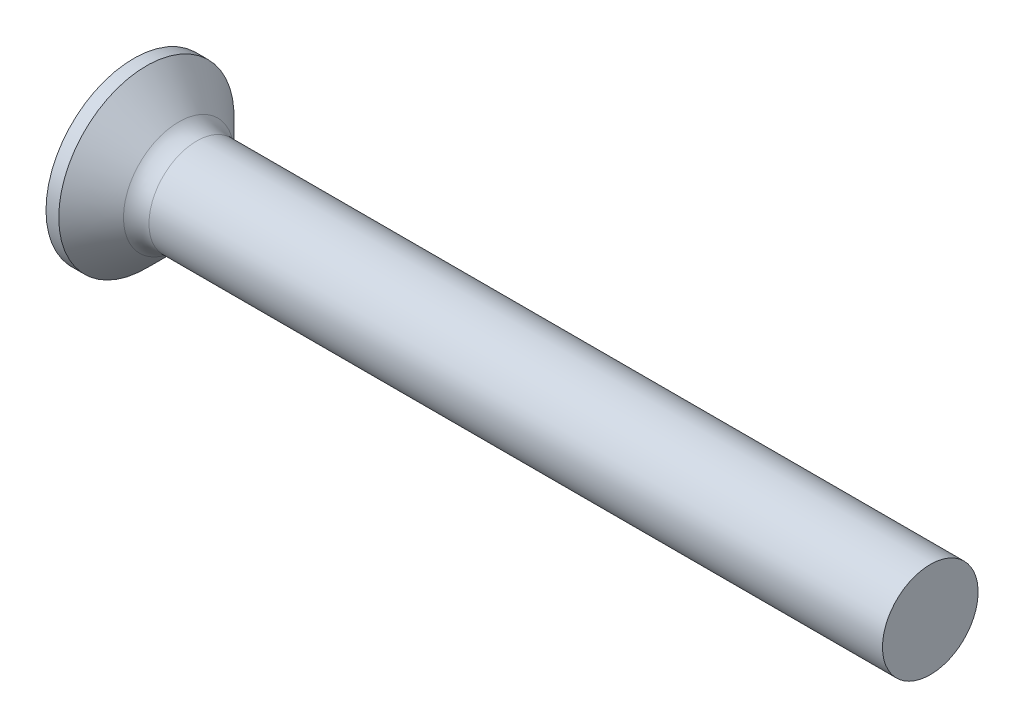
ISO-10303-21;
HEADER;
FILE_DESCRIPTION(('STEP AP214'),'2;1');
FILE_NAME('part.step','',(''),(''),'','','');
FILE_SCHEMA(('AUTOMOTIVE_DESIGN { 1 0 10303 214 1 1 1 1 }'));
ENDSEC;
DATA;
#1=APPLICATION_CONTEXT('core data for automotive mechanical design processes');
#2=APPLICATION_PROTOCOL_DEFINITION('international standard','automotive_design',2000,#1);
#3=PRODUCT_CONTEXT('',#1,'mechanical');
#4=PRODUCT('Part','Part','',(#3));
#5=PRODUCT_RELATED_PRODUCT_CATEGORY('part','',(#4));
#6=PRODUCT_DEFINITION_FORMATION('','',#4);
#7=PRODUCT_DEFINITION_CONTEXT('part definition',#1,'design');
#8=PRODUCT_DEFINITION('design','',#6,#7);
#9=PRODUCT_DEFINITION_SHAPE('','',#8);
#10=(LENGTH_UNIT() NAMED_UNIT(*) SI_UNIT(.MILLI.,.METRE.));
#11=(NAMED_UNIT(*) PLANE_ANGLE_UNIT() SI_UNIT($,.RADIAN.));
#12=(NAMED_UNIT(*) SI_UNIT($,.STERADIAN.) SOLID_ANGLE_UNIT());
#13=UNCERTAINTY_MEASURE_WITH_UNIT(LENGTH_MEASURE(1.E-05),#10,'distance_accuracy_value','');
#14=(GEOMETRIC_REPRESENTATION_CONTEXT(3) GLOBAL_UNCERTAINTY_ASSIGNED_CONTEXT((#13)) GLOBAL_UNIT_ASSIGNED_CONTEXT((#10,
#11,#12)) REPRESENTATION_CONTEXT('',''));
#15=CARTESIAN_POINT('',(0.,0.,0.));
#16=DIRECTION('',(0.,0.,1.));
#17=DIRECTION('',(1.,0.,0.));
#18=AXIS2_PLACEMENT_3D('',#15,#16,#17);
#19=CARTESIAN_POINT('',(0.,0.,0.));
#20=DIRECTION('',(-1.,0.,0.));
#21=DIRECTION('',(0.,0.,1.));
#22=AXIS2_PLACEMENT_3D('',#19,#20,#21);
#23=PLANE('',#22);
#24=CARTESIAN_POINT('',(0.,0.,0.));
#25=DIRECTION('',(-1.,0.,0.));
#26=DIRECTION('',(0.,0.,1.));
#27=AXIS2_PLACEMENT_3D('',#24,#25,#26);
#28=CIRCLE('',#27,2.75);
#29=CARTESIAN_POINT('',(0.,0.,2.75));
#30=VERTEX_POINT('',#29);
#31=EDGE_CURVE('E343',#30,#30,#28,.T.);
#32=ORIENTED_EDGE('',*,*,#31,.T.);
#33=EDGE_LOOP('',(#32));
#34=FACE_BOUND('',#33,.T.);
#35=DIRECTION('',(0.,0.,-1.));
#36=VECTOR('',#35,1.);
#37=CARTESIAN_POINT('',(0.,-0.370000000000005,1.5));
#38=LINE('',#37,#36);
#39=CARTESIAN_POINT('',(0.,-0.370000000000005,1.5));
#40=VERTEX_POINT('',#39);
#41=CARTESIAN_POINT('',(0.,-0.370000000000002,0.590157547916262));
#42=VERTEX_POINT('',#41);
#43=EDGE_CURVE('E382',#40,#42,#38,.T.);
#44=ORIENTED_EDGE('',*,*,#43,.T.);
#45=CARTESIAN_POINT('',(0.,0.,0.));
#46=DIRECTION('',(-1.,0.,0.));
#47=DIRECTION('',(0.,0.,1.));
#48=AXIS2_PLACEMENT_3D('',#45,#46,#47);
#49=CIRCLE('',#48,0.696552892006441);
#50=CARTESIAN_POINT('',(0.,-0.590157547916263,0.37));
#51=VERTEX_POINT('',#50);
#52=EDGE_CURVE('E369',#51,#42,#49,.T.);
#53=ORIENTED_EDGE('',*,*,#52,.F.);
#54=DIRECTION('',(0.,-1.,0.));
#55=VECTOR('',#54,1.);
#56=CARTESIAN_POINT('',(0.,1.5,0.37));
#57=LINE('',#56,#55);
#58=CARTESIAN_POINT('',(0.,-1.5,0.37));
#59=VERTEX_POINT('',#58);
#60=EDGE_CURVE('E429',#51,#59,#57,.T.);
#61=ORIENTED_EDGE('',*,*,#60,.T.);
#62=DIRECTION('',(0.,0.,-1.));
#63=VECTOR('',#62,1.);
#64=CARTESIAN_POINT('',(0.,-1.5,0.37));
#65=LINE('',#64,#63);
#66=CARTESIAN_POINT('',(0.,-1.5,-0.37));
#67=VERTEX_POINT('',#66);
#68=EDGE_CURVE('E340',#59,#67,#65,.T.);
#69=ORIENTED_EDGE('',*,*,#68,.T.);
#70=DIRECTION('',(0.,1.,0.));
#71=VECTOR('',#70,1.);
#72=CARTESIAN_POINT('',(0.,-1.5,-0.37));
#73=LINE('',#72,#71);
#74=CARTESIAN_POINT('',(0.,-0.590157547916263,-0.37));
#75=VERTEX_POINT('',#74);
#76=EDGE_CURVE('E430',#67,#75,#73,.T.);
#77=ORIENTED_EDGE('',*,*,#76,.T.);
#78=CARTESIAN_POINT('',(0.,-0.369999999999998,-0.590157547916264));
#79=VERTEX_POINT('',#78);
#80=EDGE_CURVE('E375',#79,#75,#49,.T.);
#81=ORIENTED_EDGE('',*,*,#80,.F.);
#82=CARTESIAN_POINT('',(0.,-0.369999999999995,-1.5));
#83=VERTEX_POINT('',#82);
#84=EDGE_CURVE('E391',#79,#83,#38,.T.);
#85=ORIENTED_EDGE('',*,*,#84,.T.);
#86=DIRECTION('',(0.,1.,0.));
#87=VECTOR('',#86,1.);
#88=CARTESIAN_POINT('',(0.,-0.369999999999995,-1.5));
#89=LINE('',#88,#87);
#90=CARTESIAN_POINT('',(0.,0.370000000000005,-1.5));
#91=VERTEX_POINT('',#90);
#92=EDGE_CURVE('E390',#83,#91,#89,.T.);
#93=ORIENTED_EDGE('',*,*,#92,.T.);
#94=DIRECTION('',(0.,0.,1.));
#95=VECTOR('',#94,1.);
#96=CARTESIAN_POINT('',(0.,0.370000000000005,-1.5));
#97=LINE('',#96,#95);
#98=CARTESIAN_POINT('',(0.,0.370000000000002,-0.590157547916262));
#99=VERTEX_POINT('',#98);
#100=EDGE_CURVE('E397',#91,#99,#97,.T.);
#101=ORIENTED_EDGE('',*,*,#100,.T.);
#102=CARTESIAN_POINT('',(0.,0.590157547916263,-0.37));
#103=VERTEX_POINT('',#102);
#104=EDGE_CURVE('E465',#103,#99,#49,.T.);
#105=ORIENTED_EDGE('',*,*,#104,.F.);
#106=CARTESIAN_POINT('',(0.,1.5,-0.37));
#107=VERTEX_POINT('',#106);
#108=EDGE_CURVE('E438',#103,#107,#73,.T.);
#109=ORIENTED_EDGE('',*,*,#108,.T.);
#110=DIRECTION('',(0.,0.,1.));
#111=VECTOR('',#110,1.);
#112=CARTESIAN_POINT('',(0.,1.5,-0.37));
#113=LINE('',#112,#111);
#114=CARTESIAN_POINT('',(0.,1.5,0.37));
#115=VERTEX_POINT('',#114);
#116=EDGE_CURVE('E426',#107,#115,#113,.T.);
#117=ORIENTED_EDGE('',*,*,#116,.T.);
#118=CARTESIAN_POINT('',(0.,0.590157547916263,0.37));
#119=VERTEX_POINT('',#118);
#120=EDGE_CURVE('E431',#115,#119,#57,.T.);
#121=ORIENTED_EDGE('',*,*,#120,.T.);
#122=CARTESIAN_POINT('',(0.,0.369999999999998,0.590157547916264));
#123=VERTEX_POINT('',#122);
#124=EDGE_CURVE('E377',#123,#119,#49,.T.);
#125=ORIENTED_EDGE('',*,*,#124,.F.);
#126=CARTESIAN_POINT('',(0.,0.369999999999994,1.5));
#127=VERTEX_POINT('',#126);
#128=EDGE_CURVE('E400',#123,#127,#97,.T.);
#129=ORIENTED_EDGE('',*,*,#128,.T.);
#130=DIRECTION('',(0.,-1.,0.));
#131=VECTOR('',#130,1.);
#132=CARTESIAN_POINT('',(0.,0.369999999999994,1.5));
#133=LINE('',#132,#131);
#134=EDGE_CURVE('E389',#127,#40,#133,.T.);
#135=ORIENTED_EDGE('',*,*,#134,.T.);
#136=EDGE_LOOP('',(#44,#53,#61,#69,#77,#81,#85,#93,#101,#105,#109,#117,#121,#125,#129,#135));
#137=FACE_BOUND('',#136,.T.);
#138=ADVANCED_FACE('F36',(#34,#137),#23,.T.);
#139=CARTESIAN_POINT('',(2.01,-0.497851002391852,0.37));
#140=DIRECTION('',(0.,0.,-1.));
#141=DIRECTION('',(0.,1.,0.));
#142=AXIS2_PLACEMENT_3D('',#139,#140,#141);
#143=PLANE('',#142);
#144=ORIENTED_EDGE('',*,*,#60,.F.);
#145=CARTESIAN_POINT('',(-1.01053649699026,-0.672102030078459,0.37));
#146=CARTESIAN_POINT('',(-0.799706058781648,-0.65526709888962,0.37));
#147=CARTESIAN_POINT('',(-0.588886212565099,-0.638297110577309,0.37));
#148=CARTESIAN_POINT('',(-0.167272662573758,-0.603984130523453,0.37));
#149=CARTESIAN_POINT('',(0.0435210405937222,-0.586641131327185,0.37));
#150=CARTESIAN_POINT('',(0.465068838236453,-0.551479911668094,0.37));
#151=CARTESIAN_POINT('',(0.675822932725248,-0.533661691368078,0.37));
#152=CARTESIAN_POINT('',(1.09727362087867,-0.497387538868943,0.37));
#153=CARTESIAN_POINT('',(1.30797021528206,-0.478931615293404,0.37));
#154=CARTESIAN_POINT('',(1.67418894765493,-0.446067164114376,0.37));
#155=CARTESIAN_POINT('',(1.82972932594025,-0.431862501020785,0.37));
#156=CARTESIAN_POINT('',(2.14074770367772,-0.402797709732015,0.37));
#157=CARTESIAN_POINT('',(2.29622570364503,-0.38793758706717,0.37));
#158=CARTESIAN_POINT('',(2.60710169356699,-0.357305117929346,0.37));
#159=CARTESIAN_POINT('',(2.76249967848536,-0.341532719782115,0.37));
#160=CARTESIAN_POINT('',(2.99549070750468,-0.316847908272697,0.37));
#161=CARTESIAN_POINT('',(3.07313791127142,-0.308448465888147,0.37));
#162=CARTESIAN_POINT('',(3.22838341584044,-0.291202251038988,0.37));
#163=CARTESIAN_POINT('',(3.30598171607669,-0.282355473489553,0.37));
#164=CARTESIAN_POINT('',(3.38354828471668,-0.273232461280215,0.37));
#165=B_SPLINE_CURVE_WITH_KNOTS('',3,(#145,#146,#147,#148,#149,#150,#151,#152,#153,#154,#155,
#156,#157,#158,#159,#160,#161,#162,#163,#164),.UNSPECIFIED.,.F.,.F.,(4,2,2,2,2,2,2,2,2,4),(0.,
0.634504777580944,1.26902224771403,1.90353950046914,2.53804817608336,3.00661008454961,
3.47516804035678,3.94375256285268,4.17805198347564,4.41235406796206),.UNSPECIFIED.);
#166=CARTESIAN_POINT('',(2.01,-0.415013252800436,0.37));
#167=VERTEX_POINT('',#166);
#168=EDGE_CURVE('E372',#51,#167,#165,.T.);
#169=ORIENTED_EDGE('',*,*,#168,.T.);
#170=DIRECTION('',(0.,-1.,0.));
#171=VECTOR('',#170,1.);
#172=CARTESIAN_POINT('',(2.01,0.497851002391851,0.37));
#173=LINE('',#172,#171);
#174=CARTESIAN_POINT('',(2.01,-0.497851002391852,0.37));
#175=VERTEX_POINT('',#174);
#176=EDGE_CURVE('E445',#167,#175,#173,.T.);
#177=ORIENTED_EDGE('',*,*,#176,.T.);
#178=DIRECTION('',(0.894934367749961,0.446197800778958,0.));
#179=VECTOR('',#178,1.);
#180=CARTESIAN_POINT('',(0.,-1.5,0.37));
#181=LINE('',#180,#179);
#182=EDGE_CURVE('E318',#59,#175,#181,.T.);
#183=ORIENTED_EDGE('',*,*,#182,.F.);
#184=EDGE_LOOP('',(#144,#169,#177,#183));
#185=FACE_BOUND('',#184,.T.);
#186=ADVANCED_FACE('F190',(#185),#143,.T.);
#187=CARTESIAN_POINT('',(2.01,0.497851002391851,0.37));
#188=VERTEX_POINT('',#187);
#189=CARTESIAN_POINT('',(2.01,0.415013252800437,0.37));
#190=VERTEX_POINT('',#189);
#191=EDGE_CURVE('E327',#188,#190,#173,.T.);
#192=ORIENTED_EDGE('',*,*,#191,.T.);
#193=CARTESIAN_POINT('',(-1.01053649699026,0.672102030078459,0.37));
#194=CARTESIAN_POINT('',(-0.799706058781648,0.65526709888962,0.37));
#195=CARTESIAN_POINT('',(-0.588886212565099,0.63829711057731,0.37));
#196=CARTESIAN_POINT('',(-0.167272662573758,0.603984130523453,0.37));
#197=CARTESIAN_POINT('',(0.0435210405937219,0.586641131327185,0.37));
#198=CARTESIAN_POINT('',(0.465068838236453,0.551479911668094,0.37));
#199=CARTESIAN_POINT('',(0.675822932725248,0.533661691368078,0.37));
#200=CARTESIAN_POINT('',(1.09727362087867,0.497387538868943,0.37));
#201=CARTESIAN_POINT('',(1.30797021528206,0.478931615293404,0.37));
#202=CARTESIAN_POINT('',(1.67418894765493,0.446067164114376,0.37));
#203=CARTESIAN_POINT('',(1.82972932594025,0.431862501020785,0.37));
#204=CARTESIAN_POINT('',(2.14074770367772,0.402797709732015,0.37));
#205=CARTESIAN_POINT('',(2.29622570364503,0.38793758706717,0.37));
#206=CARTESIAN_POINT('',(2.60710169356699,0.357305117929346,0.37));
#207=CARTESIAN_POINT('',(2.76249967848536,0.341532719782115,0.37));
#208=CARTESIAN_POINT('',(2.99549070750468,0.316847908272697,0.37));
#209=CARTESIAN_POINT('',(3.07313791127142,0.308448465888147,0.37));
#210=CARTESIAN_POINT('',(3.22838341584044,0.291202251038988,0.37));
#211=CARTESIAN_POINT('',(3.30598171607669,0.282355473489553,0.37));
#212=CARTESIAN_POINT('',(3.38354828471668,0.273232461280215,0.37));
#213=B_SPLINE_CURVE_WITH_KNOTS('',3,(#193,#194,#195,#196,#197,#198,#199,#200,#201,#202,#203,
#204,#205,#206,#207,#208,#209,#210,#211,#212),.UNSPECIFIED.,.F.,.F.,(4,2,2,2,2,2,2,2,2,4),(0.,
0.634504777580944,1.26902224771403,1.90353950046914,2.53804817608336,3.00661008454961,
3.47516804035678,3.94375256285268,4.17805198347564,4.41235406796206),.UNSPECIFIED.);
#214=EDGE_CURVE('E250',#190,#119,#213,.F.);
#215=ORIENTED_EDGE('',*,*,#214,.T.);
#216=ORIENTED_EDGE('',*,*,#120,.F.);
#217=DIRECTION('',(0.89493436774996,-0.446197800778958,0.));
#218=VECTOR('',#217,1.);
#219=CARTESIAN_POINT('',(0.,1.5,0.37));
#220=LINE('',#219,#218);
#221=EDGE_CURVE('E59',#115,#188,#220,.T.);
#222=ORIENTED_EDGE('',*,*,#221,.T.);
#223=EDGE_LOOP('',(#192,#215,#216,#222));
#224=FACE_BOUND('',#223,.T.);
#225=ADVANCED_FACE('F195',(#224),#143,.T.);
#226=CARTESIAN_POINT('',(2.01,0.49785100239185,-0.37));
#227=DIRECTION('',(0.,0.,1.));
#228=DIRECTION('',(1.,0.,0.));
#229=AXIS2_PLACEMENT_3D('',#226,#227,#228);
#230=PLANE('',#229);
#231=DIRECTION('',(0.,1.,0.));
#232=VECTOR('',#231,1.);
#233=CARTESIAN_POINT('',(2.01,-0.497851002391851,-0.37));
#234=LINE('',#233,#232);
#235=CARTESIAN_POINT('',(2.01,-0.497851002391851,-0.37));
#236=VERTEX_POINT('',#235);
#237=CARTESIAN_POINT('',(2.01,-0.415013252800436,-0.37));
#238=VERTEX_POINT('',#237);
#239=EDGE_CURVE('E331',#236,#238,#234,.T.);
#240=ORIENTED_EDGE('',*,*,#239,.T.);
#241=CARTESIAN_POINT('',(-1.01053649699026,-0.672102030078459,-0.37));
#242=CARTESIAN_POINT('',(-0.799706058781648,-0.65526709888962,-0.37));
#243=CARTESIAN_POINT('',(-0.588886212565099,-0.638297110577309,-0.37));
#244=CARTESIAN_POINT('',(-0.167272662573758,-0.603984130523453,-0.37));
#245=CARTESIAN_POINT('',(0.0435210405937219,-0.586641131327185,-0.37));
#246=CARTESIAN_POINT('',(0.465068838236453,-0.551479911668094,-0.37));
#247=CARTESIAN_POINT('',(0.675822932725248,-0.533661691368078,-0.37));
#248=CARTESIAN_POINT('',(1.09727362087867,-0.497387538868943,-0.37));
#249=CARTESIAN_POINT('',(1.30797021528206,-0.478931615293404,-0.37));
#250=CARTESIAN_POINT('',(1.67418894765493,-0.446067164114376,-0.37));
#251=CARTESIAN_POINT('',(1.82972932594025,-0.431862501020785,-0.37));
#252=CARTESIAN_POINT('',(2.14074770367772,-0.402797709732015,-0.37));
#253=CARTESIAN_POINT('',(2.29622570364503,-0.387937587067169,-0.37));
#254=CARTESIAN_POINT('',(2.60710169356699,-0.357305117929346,-0.37));
#255=CARTESIAN_POINT('',(2.76249967848536,-0.341532719782115,-0.37));
#256=CARTESIAN_POINT('',(2.99549070750468,-0.316847908272697,-0.37));
#257=CARTESIAN_POINT('',(3.07313791127142,-0.308448465888148,-0.37));
#258=CARTESIAN_POINT('',(3.22838341584044,-0.291202251038988,-0.37));
#259=CARTESIAN_POINT('',(3.30598171607669,-0.282355473489553,-0.37));
#260=CARTESIAN_POINT('',(3.38354828471668,-0.273232461280215,-0.37));
#261=B_SPLINE_CURVE_WITH_KNOTS('',3,(#241,#242,#243,#244,#245,#246,#247,#248,#249,#250,#251,
#252,#253,#254,#255,#256,#257,#258,#259,#260),.UNSPECIFIED.,.F.,.F.,(4,2,2,2,2,2,2,2,2,4),(0.,
0.634504777580944,1.26902224771403,1.90353950046914,2.53804817608336,3.00661008454961,
3.47516804035678,3.94375256285268,4.17805198347564,4.41235406796206),.UNSPECIFIED.);
#262=EDGE_CURVE('E244',#238,#75,#261,.F.);
#263=ORIENTED_EDGE('',*,*,#262,.T.);
#264=ORIENTED_EDGE('',*,*,#76,.F.);
#265=DIRECTION('',(0.89493436774996,0.446197800778958,0.));
#266=VECTOR('',#265,1.);
#267=CARTESIAN_POINT('',(0.,-1.5,-0.37));
#268=LINE('',#267,#266);
#269=EDGE_CURVE('E440',#67,#236,#268,.T.);
#270=ORIENTED_EDGE('',*,*,#269,.T.);
#271=EDGE_LOOP('',(#240,#263,#264,#270));
#272=FACE_BOUND('',#271,.T.);
#273=ADVANCED_FACE('F230',(#272),#230,.T.);
#274=ORIENTED_EDGE('',*,*,#108,.F.);
#275=CARTESIAN_POINT('',(-1.01053649699026,0.672102030078459,-0.37));
#276=CARTESIAN_POINT('',(-0.799706058781647,0.65526709888962,-0.37));
#277=CARTESIAN_POINT('',(-0.588886212565099,0.63829711057731,-0.37));
#278=CARTESIAN_POINT('',(-0.167272662573759,0.603984130523453,-0.37));
#279=CARTESIAN_POINT('',(0.0435210405937218,0.586641131327185,-0.37));
#280=CARTESIAN_POINT('',(0.465068838236453,0.551479911668094,-0.37));
#281=CARTESIAN_POINT('',(0.675822932725248,0.533661691368078,-0.37));
#282=CARTESIAN_POINT('',(1.09727362087867,0.497387538868943,-0.37));
#283=CARTESIAN_POINT('',(1.30797021528206,0.478931615293404,-0.37));
#284=CARTESIAN_POINT('',(1.67418894765493,0.446067164114376,-0.37));
#285=CARTESIAN_POINT('',(1.82972932594025,0.431862501020785,-0.37));
#286=CARTESIAN_POINT('',(2.14074770367772,0.402797709732015,-0.37));
#287=CARTESIAN_POINT('',(2.29622570364503,0.38793758706717,-0.37));
#288=CARTESIAN_POINT('',(2.60710169356699,0.357305117929346,-0.37));
#289=CARTESIAN_POINT('',(2.76249967848536,0.341532719782115,-0.37));
#290=CARTESIAN_POINT('',(2.99549070750468,0.316847908272697,-0.37));
#291=CARTESIAN_POINT('',(3.07313791127142,0.308448465888148,-0.37));
#292=CARTESIAN_POINT('',(3.22838341584044,0.291202251038989,-0.37));
#293=CARTESIAN_POINT('',(3.30598171607669,0.282355473489553,-0.37));
#294=CARTESIAN_POINT('',(3.38354828471668,0.273232461280215,-0.37));
#295=B_SPLINE_CURVE_WITH_KNOTS('',3,(#275,#276,#277,#278,#279,#280,#281,#282,#283,#284,#285,
#286,#287,#288,#289,#290,#291,#292,#293,#294),.UNSPECIFIED.,.F.,.F.,(4,2,2,2,2,2,2,2,2,4),(0.,
0.634504777580944,1.26902224771403,1.90353950046914,2.53804817608336,3.00661008454961,
3.47516804035678,3.94375256285268,4.17805198347564,4.41235406796206),.UNSPECIFIED.);
#296=CARTESIAN_POINT('',(2.01,0.415013252800437,-0.37));
#297=VERTEX_POINT('',#296);
#298=EDGE_CURVE('E238',#103,#297,#295,.T.);
#299=ORIENTED_EDGE('',*,*,#298,.T.);
#300=CARTESIAN_POINT('',(2.01,0.497851002391851,-0.37));
#301=VERTEX_POINT('',#300);
#302=EDGE_CURVE('E335',#297,#301,#234,.T.);
#303=ORIENTED_EDGE('',*,*,#302,.T.);
#304=DIRECTION('',(0.89493436774996,-0.446197800778958,0.));
#305=VECTOR('',#304,1.);
#306=CARTESIAN_POINT('',(0.,1.5,-0.37));
#307=LINE('',#306,#305);
#308=EDGE_CURVE('E322',#107,#301,#307,.T.);
#309=ORIENTED_EDGE('',*,*,#308,.F.);
#310=EDGE_LOOP('',(#274,#299,#303,#309));
#311=FACE_BOUND('',#310,.T.);
#312=ADVANCED_FACE('F222',(#311),#230,.T.);
#313=CARTESIAN_POINT('',(2.01,0.497851002391851,-0.37));
#314=DIRECTION('',(1.,0.,0.));
#315=DIRECTION('',(0.,0.,-1.));
#316=AXIS2_PLACEMENT_3D('',#313,#314,#315);
#317=PLANE('',#316);
#318=CARTESIAN_POINT('',(2.01,0.,0.));
#319=DIRECTION('',(-1.,0.,0.));
#320=DIRECTION('',(0.,0.,1.));
#321=AXIS2_PLACEMENT_3D('',#318,#319,#320);
#322=CIRCLE('',#321,0.555999999999999);
#323=CARTESIAN_POINT('',(2.01,-0.247548741498371,-0.497851002391852));
#324=VERTEX_POINT('',#323);
#325=CARTESIAN_POINT('',(2.01,-0.369999999999999,-0.415013252800438));
#326=VERTEX_POINT('',#325);
#327=EDGE_CURVE('E512',#324,#326,#322,.T.);
#328=ORIENTED_EDGE('',*,*,#327,.F.);
#329=DIRECTION('',(0.,1.,0.));
#330=VECTOR('',#329,1.);
#331=CARTESIAN_POINT('',(2.01,-0.369999999999999,-0.497851002391853));
#332=LINE('',#331,#330);
#333=CARTESIAN_POINT('',(2.01,-0.369999999999999,-0.497851002391853));
#334=VERTEX_POINT('',#333);
#335=EDGE_CURVE('E412',#334,#324,#332,.T.);
#336=ORIENTED_EDGE('',*,*,#335,.F.);
#337=DIRECTION('',(0.,0.,-1.));
#338=VECTOR('',#337,1.);
#339=CARTESIAN_POINT('',(2.01,-0.370000000000002,0.497851002391849));
#340=LINE('',#339,#338);
#341=EDGE_CURVE('E416',#326,#334,#340,.T.);
#342=ORIENTED_EDGE('',*,*,#341,.F.);
#343=EDGE_LOOP('',(#328,#336,#342));
#344=FACE_BOUND('',#343,.T.);
#345=ADVANCED_FACE('F218',(#344),#317,.F.);
#346=CARTESIAN_POINT('',(2.01,-0.497851002391851,-0.247548741498372));
#347=VERTEX_POINT('',#346);
#348=EDGE_CURVE('E483',#238,#347,#322,.T.);
#349=ORIENTED_EDGE('',*,*,#348,.F.);
#350=ORIENTED_EDGE('',*,*,#239,.F.);
#351=DIRECTION('',(0.,0.,-1.));
#352=VECTOR('',#351,1.);
#353=CARTESIAN_POINT('',(2.01,-0.497851002391852,0.37));
#354=LINE('',#353,#352);
#355=EDGE_CURVE('E323',#347,#236,#354,.T.);
#356=ORIENTED_EDGE('',*,*,#355,.F.);
#357=EDGE_LOOP('',(#349,#350,#356));
#358=FACE_BOUND('',#357,.T.);
#359=ADVANCED_FACE('F221',(#358),#317,.F.);
#360=CARTESIAN_POINT('',(2.01,-0.497851002391851,0.247548741498373));
#361=VERTEX_POINT('',#360);
#362=EDGE_CURVE('E479',#361,#167,#322,.T.);
#363=ORIENTED_EDGE('',*,*,#362,.F.);
#364=EDGE_CURVE('E313',#175,#361,#354,.T.);
#365=ORIENTED_EDGE('',*,*,#364,.F.);
#366=ORIENTED_EDGE('',*,*,#176,.F.);
#367=EDGE_LOOP('',(#363,#365,#366));
#368=FACE_BOUND('',#367,.T.);
#369=ADVANCED_FACE('F477',(#368),#317,.F.);
#370=CARTESIAN_POINT('',(2.01,-0.370000000000002,0.415013252800435));
#371=VERTEX_POINT('',#370);
#372=CARTESIAN_POINT('',(2.01,-0.247548741498375,0.49785100239185));
#373=VERTEX_POINT('',#372);
#374=EDGE_CURVE('E51',#371,#373,#322,.T.);
#375=ORIENTED_EDGE('',*,*,#374,.F.);
#376=CARTESIAN_POINT('',(2.01,-0.370000000000002,0.49785100239185));
#377=VERTEX_POINT('',#376);
#378=EDGE_CURVE('E385',#377,#371,#340,.T.);
#379=ORIENTED_EDGE('',*,*,#378,.F.);
#380=DIRECTION('',(0.,-1.,0.));
#381=VECTOR('',#380,1.);
#382=CARTESIAN_POINT('',(2.01,0.369999999999998,0.497851002391852));
#383=LINE('',#382,#381);
#384=EDGE_CURVE('E417',#373,#377,#383,.T.);
#385=ORIENTED_EDGE('',*,*,#384,.F.);
#386=EDGE_LOOP('',(#375,#379,#385));
#387=FACE_BOUND('',#386,.T.);
#388=ADVANCED_FACE('F523',(#387),#317,.F.);
#389=CARTESIAN_POINT('',(2.01,0.247548741498372,0.497851002391852));
#390=VERTEX_POINT('',#389);
#391=CARTESIAN_POINT('',(2.01,0.369999999999999,0.415013252800438));
#392=VERTEX_POINT('',#391);
#393=EDGE_CURVE('E376',#390,#392,#322,.T.);
#394=ORIENTED_EDGE('',*,*,#393,.F.);
#395=CARTESIAN_POINT('',(2.01,0.369999999999998,0.497851002391852));
#396=VERTEX_POINT('',#395);
#397=EDGE_CURVE('E413',#396,#390,#383,.T.);
#398=ORIENTED_EDGE('',*,*,#397,.F.);
#399=DIRECTION('',(0.,0.,1.));
#400=VECTOR('',#399,1.);
#401=CARTESIAN_POINT('',(2.01,0.370000000000002,-0.49785100239185));
#402=LINE('',#401,#400);
#403=EDGE_CURVE('E425',#392,#396,#402,.T.);
#404=ORIENTED_EDGE('',*,*,#403,.F.);
#405=EDGE_LOOP('',(#394,#398,#404));
#406=FACE_BOUND('',#405,.T.);
#407=ADVANCED_FACE('F488',(#406),#317,.F.);
#408=CARTESIAN_POINT('',(2.01,0.497851002391851,0.247548741498374));
#409=VERTEX_POINT('',#408);
#410=EDGE_CURVE('E457',#190,#409,#322,.T.);
#411=ORIENTED_EDGE('',*,*,#410,.F.);
#412=ORIENTED_EDGE('',*,*,#191,.F.);
#413=DIRECTION('',(0.,0.,1.));
#414=VECTOR('',#413,1.);
#415=CARTESIAN_POINT('',(2.01,0.497851002391851,-0.37));
#416=LINE('',#415,#414);
#417=EDGE_CURVE('E334',#409,#188,#416,.T.);
#418=ORIENTED_EDGE('',*,*,#417,.F.);
#419=EDGE_LOOP('',(#411,#412,#418));
#420=FACE_BOUND('',#419,.T.);
#421=ADVANCED_FACE('F455',(#420),#317,.F.);
#422=CARTESIAN_POINT('',(2.01,0.497851002391851,-0.247548741498374));
#423=VERTEX_POINT('',#422);
#424=EDGE_CURVE('E463',#423,#297,#322,.T.);
#425=ORIENTED_EDGE('',*,*,#424,.F.);
#426=EDGE_CURVE('E443',#301,#423,#416,.T.);
#427=ORIENTED_EDGE('',*,*,#426,.F.);
#428=ORIENTED_EDGE('',*,*,#302,.F.);
#429=EDGE_LOOP('',(#425,#427,#428));
#430=FACE_BOUND('',#429,.T.);
#431=ADVANCED_FACE('F307',(#430),#317,.F.);
#432=CARTESIAN_POINT('',(2.01,0.370000000000002,-0.415013252800435));
#433=VERTEX_POINT('',#432);
#434=CARTESIAN_POINT('',(2.01,0.247548741498374,-0.49785100239185));
#435=VERTEX_POINT('',#434);
#436=EDGE_CURVE('E506',#433,#435,#322,.T.);
#437=ORIENTED_EDGE('',*,*,#436,.F.);
#438=CARTESIAN_POINT('',(2.01,0.370000000000002,-0.49785100239185));
#439=VERTEX_POINT('',#438);
#440=EDGE_CURVE('E422',#439,#433,#402,.T.);
#441=ORIENTED_EDGE('',*,*,#440,.F.);
#442=EDGE_CURVE('E419',#435,#439,#332,.T.);
#443=ORIENTED_EDGE('',*,*,#442,.F.);
#444=EDGE_LOOP('',(#437,#441,#443));
#445=FACE_BOUND('',#444,.T.);
#446=ADVANCED_FACE('F224',(#445),#317,.F.);
#447=CARTESIAN_POINT('',(0.,-1.5,-0.37));
#448=DIRECTION('',(-0.446197800778958,0.89493436774996,0.));
#449=DIRECTION('',(-0.89493436774996,-0.446197800778958,0.));
#450=AXIS2_PLACEMENT_3D('',#447,#448,#449);
#451=PLANE('',#450);
#452=ORIENTED_EDGE('',*,*,#364,.T.);
#453=CARTESIAN_POINT('',(2.86902882959523,-0.0695550419463994,0.));
#454=DIRECTION('',(-0.446197800778958,0.89493436774996,0.));
#455=DIRECTION('',(-0.89493436774996,-0.446197800778958,0.));
#456=AXIS2_PLACEMENT_3D('',#453,#454,#455);
#457=ELLIPSE('',#456,1.11145965245249,0.491029028347017);
#458=EDGE_CURVE('E314',#361,#347,#457,.F.);
#459=ORIENTED_EDGE('',*,*,#458,.T.);
#460=ORIENTED_EDGE('',*,*,#355,.T.);
#461=ORIENTED_EDGE('',*,*,#269,.F.);
#462=ORIENTED_EDGE('',*,*,#68,.F.);
#463=ORIENTED_EDGE('',*,*,#182,.T.);
#464=EDGE_LOOP('',(#452,#459,#460,#461,#462,#463));
#465=FACE_BOUND('',#464,.T.);
#466=ADVANCED_FACE('F229',(#465),#451,.T.);
#467=CARTESIAN_POINT('',(2.01,0.497851002391851,0.37));
#468=DIRECTION('',(-0.446197800778958,-0.89493436774996,0.));
#469=DIRECTION('',(0.89493436774996,-0.446197800778958,0.));
#470=AXIS2_PLACEMENT_3D('',#467,#468,#469);
#471=PLANE('',#470);
#472=ORIENTED_EDGE('',*,*,#426,.T.);
#473=CARTESIAN_POINT('',(2.86902882959523,0.0695550419463989,0.));
#474=DIRECTION('',(-0.446197800778958,-0.89493436774996,0.));
#475=DIRECTION('',(-0.89493436774996,0.446197800778958,0.));
#476=AXIS2_PLACEMENT_3D('',#473,#474,#475);
#477=ELLIPSE('',#476,1.11145965245249,0.491029028347018);
#478=EDGE_CURVE('E291',#423,#409,#477,.F.);
#479=ORIENTED_EDGE('',*,*,#478,.T.);
#480=ORIENTED_EDGE('',*,*,#417,.T.);
#481=ORIENTED_EDGE('',*,*,#221,.F.);
#482=ORIENTED_EDGE('',*,*,#116,.F.);
#483=ORIENTED_EDGE('',*,*,#308,.T.);
#484=EDGE_LOOP('',(#472,#479,#480,#481,#482,#483));
#485=FACE_BOUND('',#484,.T.);
#486=ADVANCED_FACE('F225',(#485),#471,.T.);
#487=CARTESIAN_POINT('',(2.01,0.369999999999998,0.497851002391852));
#488=DIRECTION('',(0.,-1.,0.));
#489=DIRECTION('',(1.,0.,0.));
#490=AXIS2_PLACEMENT_3D('',#487,#488,#489);
#491=PLANE('',#490);
#492=ORIENTED_EDGE('',*,*,#440,.T.);
#493=CARTESIAN_POINT('',(-1.01053649699026,0.370000000000002,-0.672102030078458));
#494=CARTESIAN_POINT('',(-0.799706058781648,0.370000000000002,-0.655267098889619));
#495=CARTESIAN_POINT('',(-0.588886212565099,0.370000000000002,-0.638297110577308));
#496=CARTESIAN_POINT('',(-0.167272662573759,0.370000000000002,-0.603984130523451));
#497=CARTESIAN_POINT('',(0.0435210405937218,0.370000000000002,-0.586641131327183));
#498=CARTESIAN_POINT('',(0.465068838236453,0.370000000000002,-0.551479911668092));
#499=CARTESIAN_POINT('',(0.675822932725247,0.370000000000002,-0.533661691368077));
#500=CARTESIAN_POINT('',(1.09727362087867,0.370000000000002,-0.497387538868941));
#501=CARTESIAN_POINT('',(1.30797021528206,0.370000000000002,-0.478931615293402));
#502=CARTESIAN_POINT('',(1.67418894765493,0.370000000000002,-0.446067164114374));
#503=CARTESIAN_POINT('',(1.82972932594025,0.370000000000002,-0.431862501020783));
#504=CARTESIAN_POINT('',(2.14074770367772,0.370000000000002,-0.402797709732014));
#505=CARTESIAN_POINT('',(2.29622570364503,0.370000000000002,-0.387937587067168));
#506=CARTESIAN_POINT('',(2.60710169356699,0.370000000000001,-0.357305117929345));
#507=CARTESIAN_POINT('',(2.76249967848536,0.370000000000001,-0.341532719782114));
#508=CARTESIAN_POINT('',(2.99549070750468,0.370000000000001,-0.316847908272696));
#509=CARTESIAN_POINT('',(3.07313791127142,0.370000000000001,-0.308448465888146));
#510=CARTESIAN_POINT('',(3.22838341584044,0.370000000000001,-0.291202251038987));
#511=CARTESIAN_POINT('',(3.30598171607669,0.370000000000001,-0.282355473489552));
#512=CARTESIAN_POINT('',(3.38354828471668,0.370000000000001,-0.273232461280213));
#513=B_SPLINE_CURVE_WITH_KNOTS('',3,(#493,#494,#495,#496,#497,#498,#499,#500,#501,#502,#503,
#504,#505,#506,#507,#508,#509,#510,#511,#512),.UNSPECIFIED.,.F.,.F.,(4,2,2,2,2,2,2,2,2,4),(0.,
0.634504777580944,1.26902224771403,1.90353950046914,2.53804817608336,3.00661008454961,
3.47516804035678,3.94375256285268,4.17805198347564,4.41235406796206),.UNSPECIFIED.);
#514=EDGE_CURVE('E284',#433,#99,#513,.F.);
#515=ORIENTED_EDGE('',*,*,#514,.T.);
#516=ORIENTED_EDGE('',*,*,#100,.F.);
#517=DIRECTION('',(0.89493436774996,0.,0.446197800778958));
#518=VECTOR('',#517,1.);
#519=CARTESIAN_POINT('',(0.,0.370000000000005,-1.5));
#520=LINE('',#519,#518);
#521=EDGE_CURVE('E404',#91,#439,#520,.T.);
#522=ORIENTED_EDGE('',*,*,#521,.T.);
#523=EDGE_LOOP('',(#492,#515,#516,#522));
#524=FACE_BOUND('',#523,.T.);
#525=ADVANCED_FACE('F228',(#524),#491,.T.);
#526=CARTESIAN_POINT('',(2.01,-0.369999999999999,-0.497851002391853));
#527=DIRECTION('',(0.,1.,0.));
#528=DIRECTION('',(0.,0.,1.));
#529=AXIS2_PLACEMENT_3D('',#526,#527,#528);
#530=PLANE('',#529);
#531=ORIENTED_EDGE('',*,*,#84,.F.);
#532=CARTESIAN_POINT('',(-1.01053649691082,-0.369999999999997,-0.672102030072119));
#533=CARTESIAN_POINT('',(-0.79970605871103,-0.369999999999998,-0.655267098883948));
#534=CARTESIAN_POINT('',(-0.588886212503304,-0.369999999999998,-0.638297110572312));
#535=CARTESIAN_POINT('',(-0.16727266252961,-0.369999999999998,-0.603984130519829));
#536=CARTESIAN_POINT('',(0.0435210406290475,-0.369999999999998,-0.58664113132426));
#537=CARTESIAN_POINT('',(0.465068838244709,-0.369999999999998,-0.551479911667386));
#538=CARTESIAN_POINT('',(0.67582293271526,-0.369999999999998,-0.53366169136891));
#539=CARTESIAN_POINT('',(1.09727362083221,-0.369999999999998,-0.497387538872972));
#540=CARTESIAN_POINT('',(1.30797021521736,-0.369999999999998,-0.47893161529909));
#541=CARTESIAN_POINT('',(1.67418894757201,-0.369999999999999,-0.446067164121906));
#542=CARTESIAN_POINT('',(1.82972932585734,-0.369999999999999,-0.431862501028415));
#543=CARTESIAN_POINT('',(2.14074770359484,-0.369999999999999,-0.40279770973988));
#544=CARTESIAN_POINT('',(2.29622570356215,-0.369999999999999,-0.387937587075171));
#545=CARTESIAN_POINT('',(2.60710169348415,-0.369999999999999,-0.357305117937677));
#546=CARTESIAN_POINT('',(2.76249967840253,-0.369999999999999,-0.341532719790641));
#547=CARTESIAN_POINT('',(2.99549070742189,-0.369999999999999,-0.316847908281595));
#548=CARTESIAN_POINT('',(3.07313791118864,-0.369999999999999,-0.308448465897183));
#549=CARTESIAN_POINT('',(3.22838341575769,-0.369999999999999,-0.29120225104834));
#550=CARTESIAN_POINT('',(3.30598171599396,-0.369999999999999,-0.282355473499083));
#551=CARTESIAN_POINT('',(3.38354828463398,-0.369999999999999,-0.273232461289951));
#552=B_SPLINE_CURVE_WITH_KNOTS('',3,(#532,#533,#534,#535,#536,#537,#538,#539,#540,#541,#542,
#543,#544,#545,#546,#547,#548,#549,#550,#551),.UNSPECIFIED.,.F.,.F.,(4,2,2,2,2,2,2,2,2,4),(0.,
0.634504777554397,1.26902224766093,1.90353950036111,2.53804817592041,3.00661008438666,
3.47516804019383,3.94375256268972,4.17805198331267,4.41235406779909),.UNSPECIFIED.);
#553=EDGE_CURVE('E278',#79,#326,#552,.T.);
#554=ORIENTED_EDGE('',*,*,#553,.T.);
#555=ORIENTED_EDGE('',*,*,#341,.T.);
#556=DIRECTION('',(0.894934367749961,0.,0.446197800778958));
#557=VECTOR('',#556,1.);
#558=CARTESIAN_POINT('',(0.,-0.369999999999995,-1.5));
#559=LINE('',#558,#557);
#560=EDGE_CURVE('E401',#83,#334,#559,.T.);
#561=ORIENTED_EDGE('',*,*,#560,.F.);
#562=EDGE_LOOP('',(#531,#554,#555,#561));
#563=FACE_BOUND('',#562,.T.);
#564=ADVANCED_FACE('F295',(#563),#530,.T.);
#565=CARTESIAN_POINT('',(0.,0.370000000000005,-1.5));
#566=DIRECTION('',(-0.446197800778958,0.,0.89493436774996));
#567=DIRECTION('',(-0.89493436774996,0.,-0.446197800778958));
#568=AXIS2_PLACEMENT_3D('',#565,#566,#567);
#569=PLANE('',#568);
#570=ORIENTED_EDGE('',*,*,#335,.T.);
#571=CARTESIAN_POINT('',(2.86902882959523,0.,-0.0695550419463993));
#572=DIRECTION('',(-0.446197800778958,0.,0.89493436774996));
#573=DIRECTION('',(-0.89493436774996,0.,-0.446197800778958));
#574=AXIS2_PLACEMENT_3D('',#571,#572,#573);
#575=ELLIPSE('',#574,1.11145965245249,0.491029028347017);
#576=EDGE_CURVE('E386',#324,#435,#575,.F.);
#577=ORIENTED_EDGE('',*,*,#576,.T.);
#578=ORIENTED_EDGE('',*,*,#442,.T.);
#579=ORIENTED_EDGE('',*,*,#521,.F.);
#580=ORIENTED_EDGE('',*,*,#92,.F.);
#581=ORIENTED_EDGE('',*,*,#560,.T.);
#582=EDGE_LOOP('',(#570,#577,#578,#579,#580,#581));
#583=FACE_BOUND('',#582,.T.);
#584=ADVANCED_FACE('F257',(#583),#569,.T.);
#585=ORIENTED_EDGE('',*,*,#378,.T.);
#586=CARTESIAN_POINT('',(-1.01053649691082,-0.370000000000002,0.672102030072116));
#587=CARTESIAN_POINT('',(-0.79970605871103,-0.370000000000002,0.655267098883946));
#588=CARTESIAN_POINT('',(-0.588886212503304,-0.370000000000002,0.63829711057231));
#589=CARTESIAN_POINT('',(-0.167272662529611,-0.370000000000002,0.603984130519827));
#590=CARTESIAN_POINT('',(0.0435210406290471,-0.370000000000002,0.586641131324257));
#591=CARTESIAN_POINT('',(0.465068838244709,-0.370000000000002,0.551479911667384));
#592=CARTESIAN_POINT('',(0.67582293271526,-0.370000000000002,0.533661691368908));
#593=CARTESIAN_POINT('',(1.09727362083221,-0.370000000000002,0.49738753887297));
#594=CARTESIAN_POINT('',(1.30797021521736,-0.370000000000002,0.478931615299088));
#595=CARTESIAN_POINT('',(1.67418894757201,-0.370000000000002,0.446067164121904));
#596=CARTESIAN_POINT('',(1.82972932585734,-0.370000000000002,0.431862501028413));
#597=CARTESIAN_POINT('',(2.14074770359484,-0.370000000000002,0.402797709739878));
#598=CARTESIAN_POINT('',(2.29622570356215,-0.370000000000002,0.387937587075168));
#599=CARTESIAN_POINT('',(2.60710169348415,-0.370000000000001,0.357305117937675));
#600=CARTESIAN_POINT('',(2.76249967840253,-0.370000000000001,0.341532719790638));
#601=CARTESIAN_POINT('',(2.99549070742189,-0.370000000000001,0.316847908281593));
#602=CARTESIAN_POINT('',(3.07313791118864,-0.370000000000001,0.30844846589718));
#603=CARTESIAN_POINT('',(3.22838341575769,-0.370000000000001,0.291202251048337));
#604=CARTESIAN_POINT('',(3.30598171599396,-0.370000000000001,0.282355473499081));
#605=CARTESIAN_POINT('',(3.38354828463398,-0.370000000000001,0.273232461289949));
#606=B_SPLINE_CURVE_WITH_KNOTS('',3,(#586,#587,#588,#589,#590,#591,#592,#593,#594,#595,#596,
#597,#598,#599,#600,#601,#602,#603,#604,#605),.UNSPECIFIED.,.F.,.F.,(4,2,2,2,2,2,2,2,2,4),(0.,
0.634504777554396,1.26902224766093,1.90353950036111,2.53804817592041,3.00661008438666,
3.47516804019383,3.94375256268972,4.17805198331267,4.41235406779909),.UNSPECIFIED.);
#607=EDGE_CURVE('E271',#371,#42,#606,.F.);
#608=ORIENTED_EDGE('',*,*,#607,.T.);
#609=ORIENTED_EDGE('',*,*,#43,.F.);
#610=DIRECTION('',(0.89493436774996,0.,-0.446197800778958));
#611=VECTOR('',#610,1.);
#612=CARTESIAN_POINT('',(0.,-0.370000000000005,1.5));
#613=LINE('',#612,#611);
#614=EDGE_CURVE('E407',#40,#377,#613,.T.);
#615=ORIENTED_EDGE('',*,*,#614,.T.);
#616=EDGE_LOOP('',(#585,#608,#609,#615));
#617=FACE_BOUND('',#616,.T.);
#618=ADVANCED_FACE('F380',(#617),#530,.T.);
#619=ORIENTED_EDGE('',*,*,#128,.F.);
#620=CARTESIAN_POINT('',(-1.01053649699026,0.369999999999997,0.67210203007846));
#621=CARTESIAN_POINT('',(-0.799706058781647,0.369999999999997,0.655267098889622));
#622=CARTESIAN_POINT('',(-0.588886212565099,0.369999999999997,0.638297110577311));
#623=CARTESIAN_POINT('',(-0.167272662573759,0.369999999999998,0.603984130523454));
#624=CARTESIAN_POINT('',(0.0435210405937218,0.369999999999998,0.586641131327186));
#625=CARTESIAN_POINT('',(0.465068838236453,0.369999999999998,0.551479911668095));
#626=CARTESIAN_POINT('',(0.675822932725248,0.369999999999998,0.53366169136808));
#627=CARTESIAN_POINT('',(1.09727362087867,0.369999999999998,0.497387538868944));
#628=CARTESIAN_POINT('',(1.30797021528206,0.369999999999998,0.478931615293405));
#629=CARTESIAN_POINT('',(1.67418894765493,0.369999999999998,0.446067164114377));
#630=CARTESIAN_POINT('',(1.82972932594025,0.369999999999999,0.431862501020786));
#631=CARTESIAN_POINT('',(2.14074770367772,0.369999999999999,0.402797709732016));
#632=CARTESIAN_POINT('',(2.29622570364503,0.369999999999999,0.387937587067171));
#633=CARTESIAN_POINT('',(2.60710169356699,0.369999999999999,0.357305117929347));
#634=CARTESIAN_POINT('',(2.76249967848536,0.369999999999999,0.341532719782116));
#635=CARTESIAN_POINT('',(2.99549070750468,0.369999999999999,0.316847908272699));
#636=CARTESIAN_POINT('',(3.07313791127142,0.369999999999999,0.308448465888149));
#637=CARTESIAN_POINT('',(3.22838341584044,0.369999999999999,0.29120225103899));
#638=CARTESIAN_POINT('',(3.30598171607669,0.369999999999999,0.282355473489554));
#639=CARTESIAN_POINT('',(3.38354828471668,0.369999999999999,0.273232461280216));
#640=B_SPLINE_CURVE_WITH_KNOTS('',3,(#620,#621,#622,#623,#624,#625,#626,#627,#628,#629,#630,
#631,#632,#633,#634,#635,#636,#637,#638,#639),.UNSPECIFIED.,.F.,.F.,(4,2,2,2,2,2,2,2,2,4),(0.,
0.634504777580944,1.26902224771403,1.90353950046914,2.53804817608336,3.00661008454961,
3.47516804035678,3.94375256285268,4.17805198347564,4.41235406796206),.UNSPECIFIED.);
#641=EDGE_CURVE('E262',#123,#392,#640,.T.);
#642=ORIENTED_EDGE('',*,*,#641,.T.);
#643=ORIENTED_EDGE('',*,*,#403,.T.);
#644=DIRECTION('',(0.89493436774996,0.,-0.446197800778958));
#645=VECTOR('',#644,1.);
#646=CARTESIAN_POINT('',(0.,0.369999999999994,1.5));
#647=LINE('',#646,#645);
#648=EDGE_CURVE('E409',#127,#396,#647,.T.);
#649=ORIENTED_EDGE('',*,*,#648,.F.);
#650=EDGE_LOOP('',(#619,#642,#643,#649));
#651=FACE_BOUND('',#650,.T.);
#652=ADVANCED_FACE('F297',(#651),#491,.T.);
#653=CARTESIAN_POINT('',(2.01,-0.370000000000002,0.497851002391849));
#654=DIRECTION('',(-0.446197800778958,0.,-0.89493436774996));
#655=DIRECTION('',(0.89493436774996,0.,-0.446197800778958));
#656=AXIS2_PLACEMENT_3D('',#653,#654,#655);
#657=PLANE('',#656);
#658=ORIENTED_EDGE('',*,*,#397,.T.);
#659=CARTESIAN_POINT('',(2.86902882959523,0.,0.0695550419463989));
#660=DIRECTION('',(-0.446197800778958,0.,-0.89493436774996));
#661=DIRECTION('',(-0.89493436774996,0.,0.446197800778958));
#662=AXIS2_PLACEMENT_3D('',#659,#660,#661);
#663=ELLIPSE('',#662,1.11145965245249,0.491029028347018);
#664=EDGE_CURVE('E11',#390,#373,#663,.F.);
#665=ORIENTED_EDGE('',*,*,#664,.T.);
#666=ORIENTED_EDGE('',*,*,#384,.T.);
#667=ORIENTED_EDGE('',*,*,#614,.F.);
#668=ORIENTED_EDGE('',*,*,#134,.F.);
#669=ORIENTED_EDGE('',*,*,#648,.T.);
#670=EDGE_LOOP('',(#658,#665,#666,#667,#668,#669));
#671=FACE_BOUND('',#670,.T.);
#672=ADVANCED_FACE('F205',(#671),#657,.T.);
#673=CARTESIAN_POINT('',(-6.34999999999999,0.,0.));
#674=DIRECTION('',(-1.,0.,0.));
#675=DIRECTION('',(0.,0.,1.));
#676=AXIS2_PLACEMENT_3D('',#673,#674,#675);
#677=CYLINDRICAL_SURFACE('',#676,2.75);
#678=CARTESIAN_POINT('',(0.400000000000006,0.,0.));
#679=DIRECTION('',(-1.,0.,0.));
#680=DIRECTION('',(0.,0.,1.));
#681=AXIS2_PLACEMENT_3D('',#678,#679,#680);
#682=CIRCLE('',#681,2.75);
#683=CARTESIAN_POINT('',(0.400000000000006,0.,2.75));
#684=VERTEX_POINT('',#683);
#685=EDGE_CURVE('E339',#684,#684,#682,.T.);
#686=ORIENTED_EDGE('',*,*,#685,.T.);
#687=EDGE_LOOP('',(#686));
#688=FACE_BOUND('',#687,.T.);
#689=ORIENTED_EDGE('',*,*,#31,.F.);
#690=EDGE_LOOP('',(#689));
#691=FACE_BOUND('',#690,.T.);
#692=ADVANCED_FACE('F201',(#688,#691),#677,.T.);
#693=CARTESIAN_POINT('',(0.400000000000006,0.,0.));
#694=DIRECTION('',(-1.,0.,0.));
#695=DIRECTION('',(0.,0.,1.));
#696=AXIS2_PLACEMENT_3D('',#693,#694,#695);
#697=CONICAL_SURFACE('',#696,2.75,0.78539816339745);
#698=CARTESIAN_POINT('',(1.41568542494924,0.,0.));
#699=DIRECTION('',(-1.,0.,0.));
#700=DIRECTION('',(0.,0.,1.));
#701=AXIS2_PLACEMENT_3D('',#698,#699,#700);
#702=CIRCLE('',#701,1.73431457505076);
#703=CARTESIAN_POINT('',(1.41568542494924,0.,1.73431457505076));
#704=VERTEX_POINT('',#703);
#705=EDGE_CURVE('E345',#704,#704,#702,.T.);
#706=ORIENTED_EDGE('',*,*,#705,.T.);
#707=EDGE_LOOP('',(#706));
#708=FACE_BOUND('',#707,.T.);
#709=ORIENTED_EDGE('',*,*,#685,.F.);
#710=EDGE_LOOP('',(#709));
#711=FACE_BOUND('',#710,.T.);
#712=ADVANCED_FACE('F204',(#708,#711),#697,.T.);
#713=CARTESIAN_POINT('',(-6.34999999999999,0.,0.));
#714=DIRECTION('',(-1.,0.,0.));
#715=DIRECTION('',(0.,0.,1.));
#716=AXIS2_PLACEMENT_3D('',#713,#714,#715);
#717=CYLINDRICAL_SURFACE('',#716,1.5);
#718=CARTESIAN_POINT('',(1.98137084989848,0.,0.));
#719=DIRECTION('',(-1.,0.,0.));
#720=DIRECTION('',(0.,0.,1.));
#721=AXIS2_PLACEMENT_3D('',#718,#719,#720);
#722=CIRCLE('',#721,1.5);
#723=CARTESIAN_POINT('',(1.98137084989848,0.,1.5));
#724=VERTEX_POINT('',#723);
#725=EDGE_CURVE('E44',#724,#724,#722,.F.);
#726=ORIENTED_EDGE('',*,*,#725,.T.);
#727=EDGE_LOOP('',(#726));
#728=FACE_BOUND('',#727,.T.);
#729=CARTESIAN_POINT('',(25.,0.,0.));
#730=DIRECTION('',(-1.,0.,0.));
#731=DIRECTION('',(0.,0.,1.));
#732=AXIS2_PLACEMENT_3D('',#729,#730,#731);
#733=CIRCLE('',#732,1.5);
#734=CARTESIAN_POINT('',(25.,0.,1.5));
#735=VERTEX_POINT('',#734);
#736=EDGE_CURVE('E336',#735,#735,#733,.T.);
#737=ORIENTED_EDGE('',*,*,#736,.T.);
#738=EDGE_LOOP('',(#737));
#739=FACE_BOUND('',#738,.T.);
#740=ADVANCED_FACE('F209',(#728,#739),#717,.T.);
#741=CARTESIAN_POINT('',(25.,1.5,0.));
#742=DIRECTION('',(1.,0.,0.));
#743=DIRECTION('',(0.,0.,-1.));
#744=AXIS2_PLACEMENT_3D('',#741,#742,#743);
#745=PLANE('',#744);
#746=ORIENTED_EDGE('',*,*,#736,.F.);
#747=EDGE_LOOP('',(#746));
#748=FACE_BOUND('',#747,.T.);
#749=ADVANCED_FACE('F213',(#748),#745,.T.);
#750=CARTESIAN_POINT('',(1.98137084989848,0.,0.));
#751=DIRECTION('',(-1.,0.,0.));
#752=DIRECTION('',(0.,0.,1.));
#753=AXIS2_PLACEMENT_3D('',#750,#751,#752);
#754=TOROIDAL_SURFACE('',#753,2.3,0.8);
#755=ORIENTED_EDGE('',*,*,#725,.F.);
#756=EDGE_LOOP('',(#755));
#757=FACE_BOUND('',#756,.T.);
#758=ORIENTED_EDGE('',*,*,#705,.F.);
#759=EDGE_LOOP('',(#758));
#760=FACE_BOUND('',#759,.T.);
#761=ADVANCED_FACE('F38',(#757,#760),#754,.F.);
#762=CARTESIAN_POINT('',(2.01,0.,0.));
#763=DIRECTION('',(-1.,0.,0.));
#764=DIRECTION('',(0.,0.,1.));
#765=AXIS2_PLACEMENT_3D('',#762,#763,#764);
#766=CONICAL_SURFACE('',#765,0.555999999999999,0.069813170079766);
#767=ORIENTED_EDGE('',*,*,#52,.T.);
#768=ORIENTED_EDGE('',*,*,#607,.F.);
#769=EDGE_CURVE('E482',#167,#371,#322,.T.);
#770=ORIENTED_EDGE('',*,*,#769,.F.);
#771=ORIENTED_EDGE('',*,*,#168,.F.);
#772=EDGE_LOOP('',(#767,#768,#770,#771));
#773=FACE_BOUND('',#772,.T.);
#774=ADVANCED_FACE('F187',(#773),#766,.F.);
#775=EDGE_CURVE('E460',#392,#190,#322,.T.);
#776=ORIENTED_EDGE('',*,*,#775,.F.);
#777=ORIENTED_EDGE('',*,*,#641,.F.);
#778=ORIENTED_EDGE('',*,*,#124,.T.);
#779=ORIENTED_EDGE('',*,*,#214,.F.);
#780=EDGE_LOOP('',(#776,#777,#778,#779));
#781=FACE_BOUND('',#780,.T.);
#782=ADVANCED_FACE('F361',(#781),#766,.F.);
#783=EDGE_CURVE('E515',#326,#238,#322,.T.);
#784=ORIENTED_EDGE('',*,*,#783,.F.);
#785=ORIENTED_EDGE('',*,*,#553,.F.);
#786=ORIENTED_EDGE('',*,*,#80,.T.);
#787=ORIENTED_EDGE('',*,*,#262,.F.);
#788=EDGE_LOOP('',(#784,#785,#786,#787));
#789=FACE_BOUND('',#788,.T.);
#790=ADVANCED_FACE('F366',(#789),#766,.F.);
#791=ORIENTED_EDGE('',*,*,#104,.T.);
#792=ORIENTED_EDGE('',*,*,#514,.F.);
#793=EDGE_CURVE('E505',#297,#433,#322,.T.);
#794=ORIENTED_EDGE('',*,*,#793,.F.);
#795=ORIENTED_EDGE('',*,*,#298,.F.);
#796=EDGE_LOOP('',(#791,#792,#794,#795));
#797=FACE_BOUND('',#796,.T.);
#798=ADVANCED_FACE('F618',(#797),#766,.F.);
#799=EDGE_CURVE('E461',#409,#423,#322,.T.);
#800=ORIENTED_EDGE('',*,*,#799,.F.);
#801=ORIENTED_EDGE('',*,*,#478,.F.);
#802=EDGE_LOOP('',(#800,#801));
#803=FACE_BOUND('',#802,.T.);
#804=ADVANCED_FACE('F626',(#803),#766,.F.);
#805=EDGE_CURVE('E481',#347,#361,#322,.T.);
#806=ORIENTED_EDGE('',*,*,#805,.F.);
#807=ORIENTED_EDGE('',*,*,#458,.F.);
#808=EDGE_LOOP('',(#806,#807));
#809=FACE_BOUND('',#808,.T.);
#810=ADVANCED_FACE('F634',(#809),#766,.F.);
#811=EDGE_CURVE('E509',#435,#324,#322,.T.);
#812=ORIENTED_EDGE('',*,*,#811,.F.);
#813=ORIENTED_EDGE('',*,*,#576,.F.);
#814=EDGE_LOOP('',(#812,#813));
#815=FACE_BOUND('',#814,.T.);
#816=ADVANCED_FACE('F184',(#815),#766,.F.);
#817=EDGE_CURVE('E464',#373,#390,#322,.T.);
#818=ORIENTED_EDGE('',*,*,#817,.F.);
#819=ORIENTED_EDGE('',*,*,#664,.F.);
#820=EDGE_LOOP('',(#818,#819));
#821=FACE_BOUND('',#820,.T.);
#822=ADVANCED_FACE('F179',(#821),#766,.F.);
#823=CARTESIAN_POINT('',(2.19065535110549,0.,0.));
#824=DIRECTION('',(-1.,0.,0.));
#825=DIRECTION('',(0.,0.,1.));
#826=AXIS2_PLACEMENT_3D('',#823,#824,#825);
#827=CONICAL_SURFACE('',#826,0.,1.25663706143592);
#828=ORIENTED_EDGE('',*,*,#393,.T.);
#829=ORIENTED_EDGE('',*,*,#775,.T.);
#830=ORIENTED_EDGE('',*,*,#410,.T.);
#831=ORIENTED_EDGE('',*,*,#799,.T.);
#832=ORIENTED_EDGE('',*,*,#424,.T.);
#833=ORIENTED_EDGE('',*,*,#793,.T.);
#834=ORIENTED_EDGE('',*,*,#436,.T.);
#835=ORIENTED_EDGE('',*,*,#811,.T.);
#836=ORIENTED_EDGE('',*,*,#327,.T.);
#837=ORIENTED_EDGE('',*,*,#783,.T.);
#838=ORIENTED_EDGE('',*,*,#348,.T.);
#839=ORIENTED_EDGE('',*,*,#805,.T.);
#840=ORIENTED_EDGE('',*,*,#362,.T.);
#841=ORIENTED_EDGE('',*,*,#769,.T.);
#842=ORIENTED_EDGE('',*,*,#374,.T.);
#843=ORIENTED_EDGE('',*,*,#817,.T.);
#844=EDGE_LOOP('',(#828,#829,#830,#831,#832,#833,#834,#835,#836,#837,#838,#839,#840,#841,#842,#843));
#845=FACE_BOUND('',#844,.T.);
#846=CARTESIAN_POINT('',(2.19065535110549,0.,0.));
#847=VERTEX_POINT('',#846);
#848=VERTEX_LOOP('',#847);
#849=FACE_BOUND('',#848,.T.);
#850=ADVANCED_FACE('F177',(#845,#849),#827,.F.);
#851=CLOSED_SHELL('',(#138,#186,#225,#273,#312,#345,#359,#369,#388,#407,#421,#431,#446,#466,
#486,#525,#564,#584,#618,#652,#672,#692,#712,#740,#749,#761,#774,#782,#790,#798,#804,#810,#816,
#822,#850));
#852=MANIFOLD_SOLID_BREP('B2',#851);
#853=ADVANCED_BREP_SHAPE_REPRESENTATION('',(#18,#852),#14);
#854=SHAPE_DEFINITION_REPRESENTATION(#9,#853);
ENDSEC;
END-ISO-10303-21;
